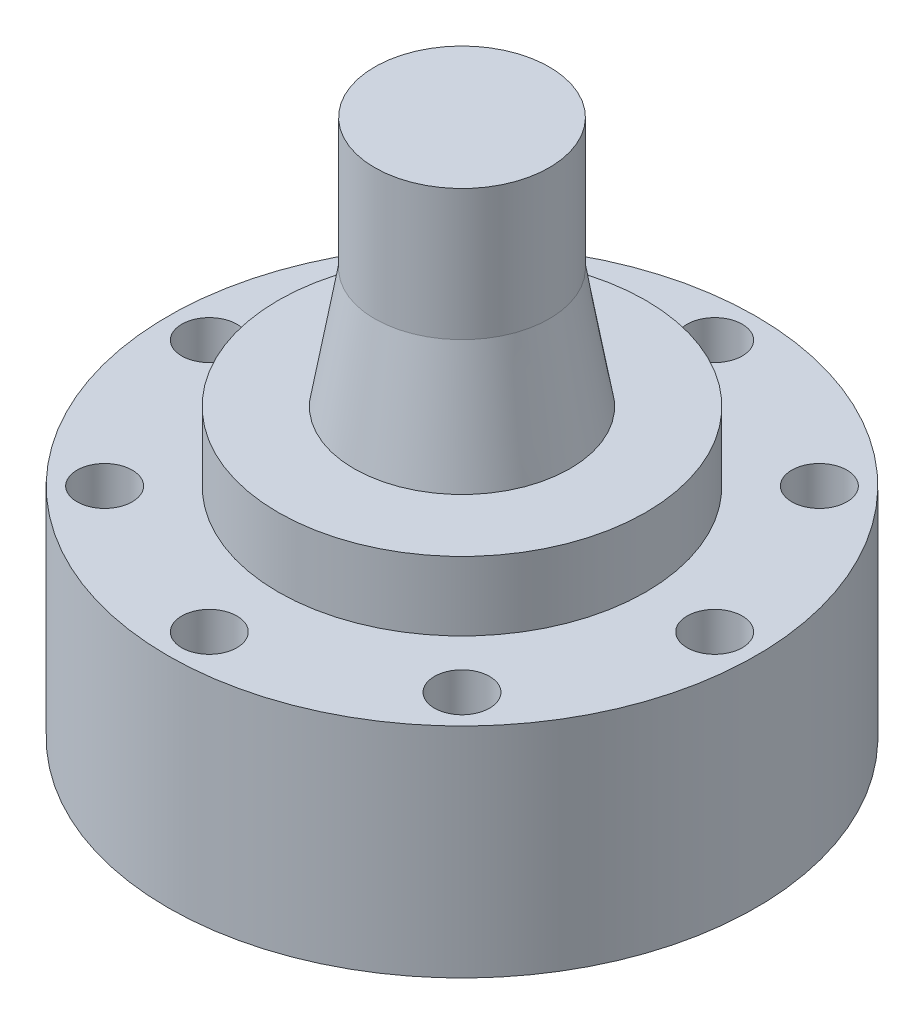
ISO-10303-21;
HEADER;
FILE_DESCRIPTION(('STEP AP214'),'2;1');
FILE_NAME('part.step','',(''),(''),'','','');
FILE_SCHEMA(('AUTOMOTIVE_DESIGN { 1 0 10303 214 1 1 1 1 }'));
ENDSEC;
DATA;
#1=APPLICATION_CONTEXT('core data for automotive mechanical design processes');
#2=APPLICATION_PROTOCOL_DEFINITION('international standard','automotive_design',2000,#1);
#3=PRODUCT_CONTEXT('',#1,'mechanical');
#4=PRODUCT('Part','Part','',(#3));
#5=PRODUCT_RELATED_PRODUCT_CATEGORY('part','',(#4));
#6=PRODUCT_DEFINITION_FORMATION('','',#4);
#7=PRODUCT_DEFINITION_CONTEXT('part definition',#1,'design');
#8=PRODUCT_DEFINITION('design','',#6,#7);
#9=PRODUCT_DEFINITION_SHAPE('','',#8);
#10=(LENGTH_UNIT() NAMED_UNIT(*) SI_UNIT(.MILLI.,.METRE.));
#11=(NAMED_UNIT(*) PLANE_ANGLE_UNIT() SI_UNIT($,.RADIAN.));
#12=(NAMED_UNIT(*) SI_UNIT($,.STERADIAN.) SOLID_ANGLE_UNIT());
#13=UNCERTAINTY_MEASURE_WITH_UNIT(LENGTH_MEASURE(1.E-05),#10,'distance_accuracy_value','');
#14=(GEOMETRIC_REPRESENTATION_CONTEXT(3) GLOBAL_UNCERTAINTY_ASSIGNED_CONTEXT((#13)) GLOBAL_UNIT_ASSIGNED_CONTEXT((#10,
#11,#12)) REPRESENTATION_CONTEXT('',''));
#15=CARTESIAN_POINT('',(0.,0.,0.));
#16=DIRECTION('',(0.,0.,1.));
#17=DIRECTION('',(1.,0.,0.));
#18=AXIS2_PLACEMENT_3D('',#15,#16,#17);
#19=CARTESIAN_POINT('',(0.,9.5,0.));
#20=DIRECTION('',(0.,1.,0.));
#21=DIRECTION('',(0.,0.,1.));
#22=AXIS2_PLACEMENT_3D('',#19,#20,#21);
#23=PLANE('',#22);
#24=CARTESIAN_POINT('',(0.,9.5,0.));
#25=DIRECTION('',(0.,1.,0.));
#26=DIRECTION('',(0.,0.,1.));
#27=AXIS2_PLACEMENT_3D('',#24,#25,#26);
#28=CIRCLE('',#27,4.7);
#29=CARTESIAN_POINT('',(0.,9.5,4.7));
#30=VERTEX_POINT('',#29);
#31=EDGE_CURVE('E10',#30,#30,#28,.T.);
#32=ORIENTED_EDGE('',*,*,#31,.F.);
#33=EDGE_LOOP('',(#32));
#34=FACE_BOUND('',#33,.T.);
#35=CARTESIAN_POINT('',(0.,9.5,0.));
#36=DIRECTION('',(0.,1.,0.));
#37=DIRECTION('',(0.,0.,1.));
#38=AXIS2_PLACEMENT_3D('',#35,#36,#37);
#39=CIRCLE('',#38,8.);
#40=CARTESIAN_POINT('',(0.,9.5,8.));
#41=VERTEX_POINT('',#40);
#42=EDGE_CURVE('E110',#41,#41,#39,.T.);
#43=ORIENTED_EDGE('',*,*,#42,.T.);
#44=EDGE_LOOP('',(#43));
#45=FACE_BOUND('',#44,.T.);
#46=ADVANCED_FACE('F35',(#34,#45),#23,.T.);
#47=CARTESIAN_POINT('',(0.,14.7,0.));
#48=DIRECTION('',(0.,-1.,0.));
#49=DIRECTION('',(0.,0.,-1.));
#50=AXIS2_PLACEMENT_3D('',#47,#48,#49);
#51=CONICAL_SURFACE('',#50,3.8,0.171379126389508);
#52=ORIENTED_EDGE('',*,*,#31,.T.);
#53=EDGE_LOOP('',(#52));
#54=FACE_BOUND('',#53,.T.);
#55=CARTESIAN_POINT('',(0.,14.7,0.));
#56=DIRECTION('',(0.,1.,0.));
#57=DIRECTION('',(0.,0.,1.));
#58=AXIS2_PLACEMENT_3D('',#55,#56,#57);
#59=CIRCLE('',#58,3.8);
#60=CARTESIAN_POINT('',(0.,14.7,3.8));
#61=VERTEX_POINT('',#60);
#62=EDGE_CURVE('E48',#61,#61,#59,.T.);
#63=ORIENTED_EDGE('',*,*,#62,.F.);
#64=EDGE_LOOP('',(#63));
#65=FACE_BOUND('',#64,.T.);
#66=ADVANCED_FACE('F158',(#54,#65),#51,.T.);
#67=CARTESIAN_POINT('',(0.,15.1881648669932,0.));
#68=DIRECTION('',(0.,1.,0.));
#69=DIRECTION('',(0.,0.,1.));
#70=AXIS2_PLACEMENT_3D('',#67,#68,#69);
#71=CYLINDRICAL_SURFACE('',#70,3.8);
#72=ORIENTED_EDGE('',*,*,#62,.T.);
#73=EDGE_LOOP('',(#72));
#74=FACE_BOUND('',#73,.T.);
#75=CARTESIAN_POINT('',(0.,20.4,0.));
#76=DIRECTION('',(0.,1.,0.));
#77=DIRECTION('',(0.,0.,1.));
#78=AXIS2_PLACEMENT_3D('',#75,#76,#77);
#79=CIRCLE('',#78,3.8);
#80=CARTESIAN_POINT('',(0.,20.4,3.8));
#81=VERTEX_POINT('',#80);
#82=EDGE_CURVE('E52',#81,#81,#79,.T.);
#83=ORIENTED_EDGE('',*,*,#82,.F.);
#84=EDGE_LOOP('',(#83));
#85=FACE_BOUND('',#84,.T.);
#86=ADVANCED_FACE('F164',(#74,#85),#71,.T.);
#87=CARTESIAN_POINT('',(-3.8,20.4,0.));
#88=DIRECTION('',(0.,1.,0.));
#89=DIRECTION('',(0.,0.,1.));
#90=AXIS2_PLACEMENT_3D('',#87,#88,#89);
#91=PLANE('',#90);
#92=ORIENTED_EDGE('',*,*,#82,.T.);
#93=EDGE_LOOP('',(#92));
#94=FACE_BOUND('',#93,.T.);
#95=ADVANCED_FACE('F122',(#94),#91,.T.);
#96=CARTESIAN_POINT('',(0.,6.5,0.));
#97=DIRECTION('',(0.,1.,0.));
#98=DIRECTION('',(0.,0.,1.));
#99=AXIS2_PLACEMENT_3D('',#96,#97,#98);
#100=PLANE('',#99);
#101=CARTESIAN_POINT('',(0.,6.5,-11.));
#102=DIRECTION('',(0.,1.,0.));
#103=DIRECTION('',(0.,0.,1.));
#104=AXIS2_PLACEMENT_3D('',#101,#102,#103);
#105=CIRCLE('',#104,1.2);
#106=CARTESIAN_POINT('',(0.,6.5,-9.8));
#107=VERTEX_POINT('',#106);
#108=EDGE_CURVE('E91',#107,#107,#105,.T.);
#109=ORIENTED_EDGE('',*,*,#108,.F.);
#110=EDGE_LOOP('',(#109));
#111=FACE_BOUND('',#110,.T.);
#112=CARTESIAN_POINT('',(0.,6.5,0.));
#113=DIRECTION('',(0.,1.,0.));
#114=DIRECTION('',(0.,0.,1.));
#115=AXIS2_PLACEMENT_3D('',#112,#113,#114);
#116=CIRCLE('',#115,8.);
#117=CARTESIAN_POINT('',(0.,6.5,8.));
#118=VERTEX_POINT('',#117);
#119=EDGE_CURVE('E109',#118,#118,#116,.T.);
#120=ORIENTED_EDGE('',*,*,#119,.F.);
#121=EDGE_LOOP('',(#120));
#122=FACE_BOUND('',#121,.T.);
#123=CARTESIAN_POINT('',(0.,6.5,0.));
#124=DIRECTION('',(0.,1.,0.));
#125=DIRECTION('',(0.,0.,1.));
#126=AXIS2_PLACEMENT_3D('',#123,#124,#125);
#127=CIRCLE('',#126,12.8);
#128=CARTESIAN_POINT('',(0.,6.5,12.8));
#129=VERTEX_POINT('',#128);
#130=EDGE_CURVE('E106',#129,#129,#127,.T.);
#131=ORIENTED_EDGE('',*,*,#130,.T.);
#132=EDGE_LOOP('',(#131));
#133=FACE_BOUND('',#132,.T.);
#134=CARTESIAN_POINT('',(0.,6.5,11.));
#135=DIRECTION('',(0.,1.,0.));
#136=DIRECTION('',(0.,0.,1.));
#137=AXIS2_PLACEMENT_3D('',#134,#135,#136);
#138=CIRCLE('',#137,1.2);
#139=CARTESIAN_POINT('',(0.,6.5,12.2));
#140=VERTEX_POINT('',#139);
#141=EDGE_CURVE('E39',#140,#140,#138,.F.);
#142=ORIENTED_EDGE('',*,*,#141,.T.);
#143=EDGE_LOOP('',(#142));
#144=FACE_BOUND('',#143,.T.);
#145=CARTESIAN_POINT('',(-11.,6.5,9.16355818751336E-13));
#146=DIRECTION('',(0.,1.,0.));
#147=DIRECTION('',(0.,0.,1.));
#148=AXIS2_PLACEMENT_3D('',#145,#146,#147);
#149=CIRCLE('',#148,1.2);
#150=CARTESIAN_POINT('',(-11.,6.5,1.20000000000092));
#151=VERTEX_POINT('',#150);
#152=EDGE_CURVE('E103',#151,#151,#149,.F.);
#153=ORIENTED_EDGE('',*,*,#152,.T.);
#154=EDGE_LOOP('',(#153));
#155=FACE_BOUND('',#154,.T.);
#156=CARTESIAN_POINT('',(7.7781745930517,6.5,-7.77817459305235));
#157=DIRECTION('',(0.,1.,0.));
#158=DIRECTION('',(0.,0.,1.));
#159=AXIS2_PLACEMENT_3D('',#156,#157,#158);
#160=CIRCLE('',#159,1.2);
#161=CARTESIAN_POINT('',(7.7781745930517,6.5,-6.57817459305234));
#162=VERTEX_POINT('',#161);
#163=EDGE_CURVE('E100',#162,#162,#160,.F.);
#164=ORIENTED_EDGE('',*,*,#163,.T.);
#165=EDGE_LOOP('',(#164));
#166=FACE_BOUND('',#165,.T.);
#167=CARTESIAN_POINT('',(-7.77817459305126,6.5,7.77817459305278));
#168=DIRECTION('',(0.,1.,0.));
#169=DIRECTION('',(0.,0.,1.));
#170=AXIS2_PLACEMENT_3D('',#167,#168,#169);
#171=CIRCLE('',#170,1.2);
#172=CARTESIAN_POINT('',(-7.77817459305126,6.5,8.97817459305278));
#173=VERTEX_POINT('',#172);
#174=EDGE_CURVE('E97',#173,#173,#171,.F.);
#175=ORIENTED_EDGE('',*,*,#174,.T.);
#176=EDGE_LOOP('',(#175));
#177=FACE_BOUND('',#176,.T.);
#178=CARTESIAN_POINT('',(-7.77817459305257,6.5,-7.77817459305148));
#179=DIRECTION('',(0.,1.,0.));
#180=DIRECTION('',(0.,0.,1.));
#181=AXIS2_PLACEMENT_3D('',#178,#179,#180);
#182=CIRCLE('',#181,1.2);
#183=CARTESIAN_POINT('',(-7.77817459305257,6.5,-6.57817459305148));
#184=VERTEX_POINT('',#183);
#185=EDGE_CURVE('E94',#184,#184,#182,.F.);
#186=ORIENTED_EDGE('',*,*,#185,.T.);
#187=EDGE_LOOP('',(#186));
#188=FACE_BOUND('',#187,.T.);
#189=CARTESIAN_POINT('',(11.,6.5,0.));
#190=DIRECTION('',(0.,1.,0.));
#191=DIRECTION('',(0.,0.,1.));
#192=AXIS2_PLACEMENT_3D('',#189,#190,#191);
#193=CIRCLE('',#192,1.2);
#194=CARTESIAN_POINT('',(11.,6.5,1.19999999999996));
#195=VERTEX_POINT('',#194);
#196=EDGE_CURVE('E88',#195,#195,#193,.F.);
#197=ORIENTED_EDGE('',*,*,#196,.T.);
#198=EDGE_LOOP('',(#197));
#199=FACE_BOUND('',#198,.T.);
#200=CARTESIAN_POINT('',(7.77817459305203,6.5,7.77817459305201));
#201=DIRECTION('',(0.,1.,0.));
#202=DIRECTION('',(0.,0.,1.));
#203=AXIS2_PLACEMENT_3D('',#200,#201,#202);
#204=CIRCLE('',#203,1.2);
#205=CARTESIAN_POINT('',(7.77817459305203,6.5,8.97817459305201));
#206=VERTEX_POINT('',#205);
#207=EDGE_CURVE('E83',#206,#206,#204,.F.);
#208=ORIENTED_EDGE('',*,*,#207,.T.);
#209=EDGE_LOOP('',(#208));
#210=FACE_BOUND('',#209,.T.);
#211=ADVANCED_FACE('F119',(#111,#122,#133,#144,#155,#166,#177,#188,#199,#210),#100,.T.);
#212=CARTESIAN_POINT('',(0.,6.5,0.));
#213=DIRECTION('',(0.,1.,0.));
#214=DIRECTION('',(0.,0.,1.));
#215=AXIS2_PLACEMENT_3D('',#212,#213,#214);
#216=CYLINDRICAL_SURFACE('',#215,8.);
#217=ORIENTED_EDGE('',*,*,#119,.T.);
#218=EDGE_LOOP('',(#217));
#219=FACE_BOUND('',#218,.T.);
#220=ORIENTED_EDGE('',*,*,#42,.F.);
#221=EDGE_LOOP('',(#220));
#222=FACE_BOUND('',#221,.T.);
#223=ADVANCED_FACE('F116',(#219,#222),#216,.T.);
#224=CARTESIAN_POINT('',(0.,3.,0.));
#225=DIRECTION('',(0.,-1.,0.));
#226=DIRECTION('',(0.,0.,-1.));
#227=AXIS2_PLACEMENT_3D('',#224,#225,#226);
#228=PLANE('',#227);
#229=CARTESIAN_POINT('',(0.,3.,0.));
#230=DIRECTION('',(0.,-1.,0.));
#231=DIRECTION('',(0.,0.,-1.));
#232=AXIS2_PLACEMENT_3D('',#229,#230,#231);
#233=CIRCLE('',#232,5.1);
#234=CARTESIAN_POINT('',(0.,3.,-5.1));
#235=VERTEX_POINT('',#234);
#236=EDGE_CURVE('E73',#235,#235,#233,.T.);
#237=ORIENTED_EDGE('',*,*,#236,.T.);
#238=EDGE_LOOP('',(#237));
#239=FACE_BOUND('',#238,.T.);
#240=ADVANCED_FACE('F209',(#239),#228,.T.);
#241=CARTESIAN_POINT('',(0.,3.,0.));
#242=DIRECTION('',(0.,-1.,0.));
#243=DIRECTION('',(0.,0.,-1.));
#244=AXIS2_PLACEMENT_3D('',#241,#242,#243);
#245=CYLINDRICAL_SURFACE('',#244,5.1);
#246=ORIENTED_EDGE('',*,*,#236,.F.);
#247=EDGE_LOOP('',(#246));
#248=FACE_BOUND('',#247,.T.);
#249=CARTESIAN_POINT('',(0.,-3.,0.));
#250=DIRECTION('',(0.,-1.,0.));
#251=DIRECTION('',(0.,0.,-1.));
#252=AXIS2_PLACEMENT_3D('',#249,#250,#251);
#253=CIRCLE('',#252,5.1);
#254=CARTESIAN_POINT('',(0.,-3.,-5.1));
#255=VERTEX_POINT('',#254);
#256=EDGE_CURVE('E80',#255,#255,#253,.T.);
#257=ORIENTED_EDGE('',*,*,#256,.T.);
#258=EDGE_LOOP('',(#257));
#259=FACE_BOUND('',#258,.T.);
#260=ADVANCED_FACE('F203',(#248,#259),#245,.F.);
#261=CARTESIAN_POINT('',(0.,20.4,-11.));
#262=DIRECTION('',(0.,-1.,0.));
#263=DIRECTION('',(0.,0.,-1.));
#264=AXIS2_PLACEMENT_3D('',#261,#262,#263);
#265=CYLINDRICAL_SURFACE('',#264,1.2);
#266=CARTESIAN_POINT('',(0.,-3.,-11.));
#267=DIRECTION('',(0.,-1.,0.));
#268=DIRECTION('',(0.,0.,-1.));
#269=AXIS2_PLACEMENT_3D('',#266,#267,#268);
#270=CIRCLE('',#269,1.2);
#271=CARTESIAN_POINT('',(0.,-3.,-12.2));
#272=VERTEX_POINT('',#271);
#273=EDGE_CURVE('E59',#272,#272,#270,.F.);
#274=ORIENTED_EDGE('',*,*,#273,.F.);
#275=EDGE_LOOP('',(#274));
#276=FACE_BOUND('',#275,.T.);
#277=ORIENTED_EDGE('',*,*,#108,.T.);
#278=EDGE_LOOP('',(#277));
#279=FACE_BOUND('',#278,.T.);
#280=ADVANCED_FACE('F154',(#276,#279),#265,.F.);
#281=CARTESIAN_POINT('',(0.,-3.,0.));
#282=DIRECTION('',(0.,1.,0.));
#283=DIRECTION('',(0.,0.,1.));
#284=AXIS2_PLACEMENT_3D('',#281,#282,#283);
#285=CYLINDRICAL_SURFACE('',#284,12.8);
#286=CARTESIAN_POINT('',(0.,-3.,0.));
#287=DIRECTION('',(0.,1.,0.));
#288=DIRECTION('',(0.,0.,1.));
#289=AXIS2_PLACEMENT_3D('',#286,#287,#288);
#290=CIRCLE('',#289,12.8);
#291=CARTESIAN_POINT('',(0.,-3.,12.8));
#292=VERTEX_POINT('',#291);
#293=EDGE_CURVE('E43',#292,#292,#290,.T.);
#294=ORIENTED_EDGE('',*,*,#293,.T.);
#295=EDGE_LOOP('',(#294));
#296=FACE_BOUND('',#295,.T.);
#297=ORIENTED_EDGE('',*,*,#130,.F.);
#298=EDGE_LOOP('',(#297));
#299=FACE_BOUND('',#298,.T.);
#300=ADVANCED_FACE('F37',(#296,#299),#285,.T.);
#301=CARTESIAN_POINT('',(7.77817459305203,20.4,7.77817459305201));
#302=DIRECTION('',(0.,-1.,0.));
#303=DIRECTION('',(0.,0.,-1.));
#304=AXIS2_PLACEMENT_3D('',#301,#302,#303);
#305=CYLINDRICAL_SURFACE('',#304,1.2);
#306=CARTESIAN_POINT('',(7.77817459305203,-3.,7.77817459305201));
#307=DIRECTION('',(0.,-1.,0.));
#308=DIRECTION('',(0.,0.,-1.));
#309=AXIS2_PLACEMENT_3D('',#306,#307,#308);
#310=CIRCLE('',#309,1.2);
#311=CARTESIAN_POINT('',(7.77817459305203,-3.,6.57817459305201));
#312=VERTEX_POINT('',#311);
#313=EDGE_CURVE('E66',#312,#312,#310,.T.);
#314=ORIENTED_EDGE('',*,*,#313,.T.);
#315=EDGE_LOOP('',(#314));
#316=FACE_BOUND('',#315,.T.);
#317=ORIENTED_EDGE('',*,*,#207,.F.);
#318=EDGE_LOOP('',(#317));
#319=FACE_BOUND('',#318,.T.);
#320=ADVANCED_FACE('F142',(#316,#319),#305,.F.);
#321=CARTESIAN_POINT('',(11.,20.4,0.));
#322=DIRECTION('',(0.,-1.,0.));
#323=DIRECTION('',(0.,0.,-1.));
#324=AXIS2_PLACEMENT_3D('',#321,#322,#323);
#325=CYLINDRICAL_SURFACE('',#324,1.2);
#326=CARTESIAN_POINT('',(11.,-3.,0.));
#327=DIRECTION('',(0.,-1.,0.));
#328=DIRECTION('',(0.,0.,-1.));
#329=AXIS2_PLACEMENT_3D('',#326,#327,#328);
#330=CIRCLE('',#329,1.2);
#331=CARTESIAN_POINT('',(11.,-3.,-1.20000000000004));
#332=VERTEX_POINT('',#331);
#333=EDGE_CURVE('E63',#332,#332,#330,.T.);
#334=ORIENTED_EDGE('',*,*,#333,.T.);
#335=EDGE_LOOP('',(#334));
#336=FACE_BOUND('',#335,.T.);
#337=ORIENTED_EDGE('',*,*,#196,.F.);
#338=EDGE_LOOP('',(#337));
#339=FACE_BOUND('',#338,.T.);
#340=ADVANCED_FACE('F144',(#336,#339),#325,.F.);
#341=CARTESIAN_POINT('',(-7.77817459305257,20.4,-7.77817459305148));
#342=DIRECTION('',(0.,-1.,0.));
#343=DIRECTION('',(0.,0.,-1.));
#344=AXIS2_PLACEMENT_3D('',#341,#342,#343);
#345=CYLINDRICAL_SURFACE('',#344,1.2);
#346=CARTESIAN_POINT('',(-7.77817459305257,-3.,-7.77817459305148));
#347=DIRECTION('',(0.,-1.,0.));
#348=DIRECTION('',(0.,0.,-1.));
#349=AXIS2_PLACEMENT_3D('',#346,#347,#348);
#350=CIRCLE('',#349,1.2);
#351=CARTESIAN_POINT('',(-7.77817459305257,-3.,-8.97817459305148));
#352=VERTEX_POINT('',#351);
#353=EDGE_CURVE('E56',#352,#352,#350,.T.);
#354=ORIENTED_EDGE('',*,*,#353,.T.);
#355=EDGE_LOOP('',(#354));
#356=FACE_BOUND('',#355,.T.);
#357=ORIENTED_EDGE('',*,*,#185,.F.);
#358=EDGE_LOOP('',(#357));
#359=FACE_BOUND('',#358,.T.);
#360=ADVANCED_FACE('F151',(#356,#359),#345,.F.);
#361=CARTESIAN_POINT('',(-7.77817459305126,20.4,7.77817459305278));
#362=DIRECTION('',(0.,-1.,0.));
#363=DIRECTION('',(0.,0.,-1.));
#364=AXIS2_PLACEMENT_3D('',#361,#362,#363);
#365=CYLINDRICAL_SURFACE('',#364,1.2);
#366=CARTESIAN_POINT('',(-7.77817459305126,-3.,7.77817459305278));
#367=DIRECTION('',(0.,-1.,0.));
#368=DIRECTION('',(0.,0.,-1.));
#369=AXIS2_PLACEMENT_3D('',#366,#367,#368);
#370=CIRCLE('',#369,1.2);
#371=CARTESIAN_POINT('',(-7.77817459305126,-3.,6.57817459305278));
#372=VERTEX_POINT('',#371);
#373=EDGE_CURVE('E60',#372,#372,#370,.T.);
#374=ORIENTED_EDGE('',*,*,#373,.T.);
#375=EDGE_LOOP('',(#374));
#376=FACE_BOUND('',#375,.T.);
#377=ORIENTED_EDGE('',*,*,#174,.F.);
#378=EDGE_LOOP('',(#377));
#379=FACE_BOUND('',#378,.T.);
#380=ADVANCED_FACE('F215',(#376,#379),#365,.F.);
#381=CARTESIAN_POINT('',(7.7781745930517,20.4,-7.77817459305235));
#382=DIRECTION('',(0.,-1.,0.));
#383=DIRECTION('',(0.,0.,-1.));
#384=AXIS2_PLACEMENT_3D('',#381,#382,#383);
#385=CYLINDRICAL_SURFACE('',#384,1.2);
#386=CARTESIAN_POINT('',(7.7781745930517,-3.,-7.77817459305235));
#387=DIRECTION('',(0.,-1.,0.));
#388=DIRECTION('',(0.,0.,-1.));
#389=AXIS2_PLACEMENT_3D('',#386,#387,#388);
#390=CIRCLE('',#389,1.2);
#391=CARTESIAN_POINT('',(7.7781745930517,-3.,-8.97817459305235));
#392=VERTEX_POINT('',#391);
#393=EDGE_CURVE('E72',#392,#392,#390,.T.);
#394=ORIENTED_EDGE('',*,*,#393,.T.);
#395=EDGE_LOOP('',(#394));
#396=FACE_BOUND('',#395,.T.);
#397=ORIENTED_EDGE('',*,*,#163,.F.);
#398=EDGE_LOOP('',(#397));
#399=FACE_BOUND('',#398,.T.);
#400=ADVANCED_FACE('F179',(#396,#399),#385,.F.);
#401=CARTESIAN_POINT('',(-11.,20.4,9.16355818751336E-13));
#402=DIRECTION('',(0.,-1.,0.));
#403=DIRECTION('',(0.,0.,-1.));
#404=AXIS2_PLACEMENT_3D('',#401,#402,#403);
#405=CYLINDRICAL_SURFACE('',#404,1.2);
#406=CARTESIAN_POINT('',(-11.,-3.,9.16355818751336E-13));
#407=DIRECTION('',(0.,-1.,0.));
#408=DIRECTION('',(0.,0.,-1.));
#409=AXIS2_PLACEMENT_3D('',#406,#407,#408);
#410=CIRCLE('',#409,1.2);
#411=CARTESIAN_POINT('',(-11.,-3.,-1.19999999999908));
#412=VERTEX_POINT('',#411);
#413=EDGE_CURVE('E69',#412,#412,#410,.T.);
#414=ORIENTED_EDGE('',*,*,#413,.T.);
#415=EDGE_LOOP('',(#414));
#416=FACE_BOUND('',#415,.T.);
#417=ORIENTED_EDGE('',*,*,#152,.F.);
#418=EDGE_LOOP('',(#417));
#419=FACE_BOUND('',#418,.T.);
#420=ADVANCED_FACE('F171',(#416,#419),#405,.F.);
#421=CARTESIAN_POINT('',(0.,-3.,0.));
#422=DIRECTION('',(0.,1.,0.));
#423=DIRECTION('',(0.,0.,1.));
#424=AXIS2_PLACEMENT_3D('',#421,#422,#423);
#425=PLANE('',#424);
#426=ORIENTED_EDGE('',*,*,#256,.F.);
#427=EDGE_LOOP('',(#426));
#428=FACE_BOUND('',#427,.T.);
#429=CARTESIAN_POINT('',(0.,-3.,11.));
#430=DIRECTION('',(0.,-1.,0.));
#431=DIRECTION('',(0.,0.,-1.));
#432=AXIS2_PLACEMENT_3D('',#429,#430,#431);
#433=CIRCLE('',#432,1.2);
#434=CARTESIAN_POINT('',(0.,-3.,9.8));
#435=VERTEX_POINT('',#434);
#436=EDGE_CURVE('E55',#435,#435,#433,.T.);
#437=ORIENTED_EDGE('',*,*,#436,.F.);
#438=EDGE_LOOP('',(#437));
#439=FACE_BOUND('',#438,.T.);
#440=ORIENTED_EDGE('',*,*,#413,.F.);
#441=EDGE_LOOP('',(#440));
#442=FACE_BOUND('',#441,.T.);
#443=ORIENTED_EDGE('',*,*,#393,.F.);
#444=EDGE_LOOP('',(#443));
#445=FACE_BOUND('',#444,.T.);
#446=ORIENTED_EDGE('',*,*,#373,.F.);
#447=EDGE_LOOP('',(#446));
#448=FACE_BOUND('',#447,.T.);
#449=ORIENTED_EDGE('',*,*,#353,.F.);
#450=EDGE_LOOP('',(#449));
#451=FACE_BOUND('',#450,.T.);
#452=ORIENTED_EDGE('',*,*,#333,.F.);
#453=EDGE_LOOP('',(#452));
#454=FACE_BOUND('',#453,.T.);
#455=ORIENTED_EDGE('',*,*,#313,.F.);
#456=EDGE_LOOP('',(#455));
#457=FACE_BOUND('',#456,.T.);
#458=ORIENTED_EDGE('',*,*,#293,.F.);
#459=EDGE_LOOP('',(#458));
#460=FACE_BOUND('',#459,.T.);
#461=ORIENTED_EDGE('',*,*,#273,.T.);
#462=EDGE_LOOP('',(#461));
#463=FACE_BOUND('',#462,.T.);
#464=ADVANCED_FACE('F168',(#428,#439,#442,#445,#448,#451,#454,#457,#460,#463),#425,.F.);
#465=CARTESIAN_POINT('',(0.,20.4,11.));
#466=DIRECTION('',(0.,-1.,0.));
#467=DIRECTION('',(0.,0.,-1.));
#468=AXIS2_PLACEMENT_3D('',#465,#466,#467);
#469=CYLINDRICAL_SURFACE('',#468,1.2);
#470=ORIENTED_EDGE('',*,*,#436,.T.);
#471=EDGE_LOOP('',(#470));
#472=FACE_BOUND('',#471,.T.);
#473=ORIENTED_EDGE('',*,*,#141,.F.);
#474=EDGE_LOOP('',(#473));
#475=FACE_BOUND('',#474,.T.);
#476=ADVANCED_FACE('F170',(#472,#475),#469,.F.);
#477=CLOSED_SHELL('',(#46,#66,#86,#95,#211,#223,#240,#260,#280,#300,#320,#340,#360,#380,#400,
#420,#464,#476));
#478=MANIFOLD_SOLID_BREP('B2',#477);
#479=ADVANCED_BREP_SHAPE_REPRESENTATION('',(#18,#478),#14);
#480=SHAPE_DEFINITION_REPRESENTATION(#9,#479);
ENDSEC;
END-ISO-10303-21;
